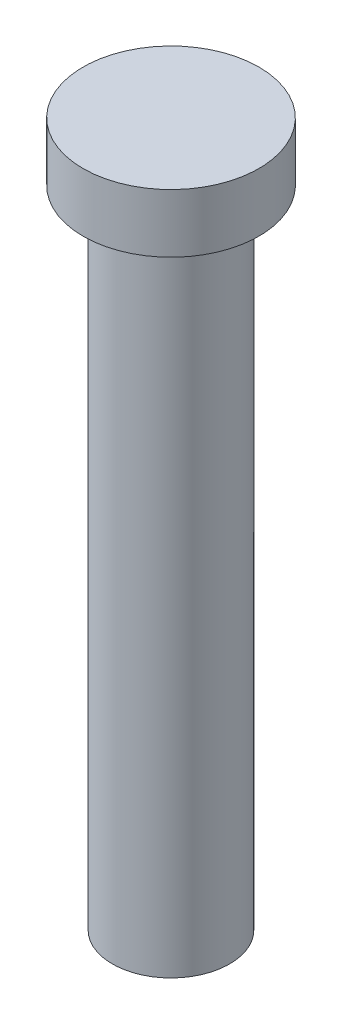
ISO-10303-21;
HEADER;
FILE_DESCRIPTION(('STEP AP214'),'2;1');
FILE_NAME('part.step','',(''),(''),'','','');
FILE_SCHEMA(('AUTOMOTIVE_DESIGN { 1 0 10303 214 1 1 1 1 }'));
ENDSEC;
DATA;
#1=APPLICATION_CONTEXT('core data for automotive mechanical design processes');
#2=APPLICATION_PROTOCOL_DEFINITION('international standard','automotive_design',2000,#1);
#3=PRODUCT_CONTEXT('',#1,'mechanical');
#4=PRODUCT('Part','Part','',(#3));
#5=PRODUCT_RELATED_PRODUCT_CATEGORY('part','',(#4));
#6=PRODUCT_DEFINITION_FORMATION('','',#4);
#7=PRODUCT_DEFINITION_CONTEXT('part definition',#1,'design');
#8=PRODUCT_DEFINITION('design','',#6,#7);
#9=PRODUCT_DEFINITION_SHAPE('','',#8);
#10=(LENGTH_UNIT() NAMED_UNIT(*) SI_UNIT(.MILLI.,.METRE.));
#11=(NAMED_UNIT(*) PLANE_ANGLE_UNIT() SI_UNIT($,.RADIAN.));
#12=(NAMED_UNIT(*) SI_UNIT($,.STERADIAN.) SOLID_ANGLE_UNIT());
#13=UNCERTAINTY_MEASURE_WITH_UNIT(LENGTH_MEASURE(1.E-05),#10,'distance_accuracy_value','');
#14=(GEOMETRIC_REPRESENTATION_CONTEXT(3) GLOBAL_UNCERTAINTY_ASSIGNED_CONTEXT((#13)) GLOBAL_UNIT_ASSIGNED_CONTEXT((#10,
#11,#12)) REPRESENTATION_CONTEXT('',''));
#15=CARTESIAN_POINT('',(0.,0.,0.));
#16=DIRECTION('',(0.,0.,1.));
#17=DIRECTION('',(1.,0.,0.));
#18=AXIS2_PLACEMENT_3D('',#15,#16,#17);
#19=CARTESIAN_POINT('',(0.,10.,0.));
#20=DIRECTION('',(0.,-1.,0.));
#21=DIRECTION('',(0.,0.,-1.));
#22=AXIS2_PLACEMENT_3D('',#19,#20,#21);
#23=CYLINDRICAL_SURFACE('',#22,15.);
#24=CARTESIAN_POINT('',(0.,10.,0.));
#25=DIRECTION('',(0.,1.,0.));
#26=DIRECTION('',(0.,0.,1.));
#27=AXIS2_PLACEMENT_3D('',#24,#25,#26);
#28=CIRCLE('',#27,15.);
#29=CARTESIAN_POINT('',(0.,10.,15.));
#30=VERTEX_POINT('',#29);
#31=EDGE_CURVE('E46',#30,#30,#28,.T.);
#32=ORIENTED_EDGE('',*,*,#31,.F.);
#33=EDGE_LOOP('',(#32));
#34=FACE_BOUND('',#33,.T.);
#35=CARTESIAN_POINT('',(0.,0.,0.));
#36=DIRECTION('',(0.,1.,0.));
#37=DIRECTION('',(0.,0.,1.));
#38=AXIS2_PLACEMENT_3D('',#35,#36,#37);
#39=CIRCLE('',#38,15.);
#40=CARTESIAN_POINT('',(0.,0.,15.));
#41=VERTEX_POINT('',#40);
#42=EDGE_CURVE('E41',#41,#41,#39,.T.);
#43=ORIENTED_EDGE('',*,*,#42,.T.);
#44=EDGE_LOOP('',(#43));
#45=FACE_BOUND('',#44,.T.);
#46=ADVANCED_FACE('F38',(#34,#45),#23,.T.);
#47=CARTESIAN_POINT('',(0.,10.,0.));
#48=DIRECTION('',(0.,1.,0.));
#49=DIRECTION('',(0.,0.,1.));
#50=AXIS2_PLACEMENT_3D('',#47,#48,#49);
#51=PLANE('',#50);
#52=ORIENTED_EDGE('',*,*,#31,.T.);
#53=EDGE_LOOP('',(#52));
#54=FACE_BOUND('',#53,.T.);
#55=ADVANCED_FACE('F66',(#54),#51,.T.);
#56=CARTESIAN_POINT('',(0.,0.,0.));
#57=DIRECTION('',(0.,1.,0.));
#58=DIRECTION('',(0.,0.,1.));
#59=AXIS2_PLACEMENT_3D('',#56,#57,#58);
#60=PLANE('',#59);
#61=CARTESIAN_POINT('',(0.,0.,0.));
#62=DIRECTION('',(0.,-1.,0.));
#63=DIRECTION('',(0.,0.,-1.));
#64=AXIS2_PLACEMENT_3D('',#61,#62,#63);
#65=CIRCLE('',#64,10.);
#66=CARTESIAN_POINT('',(0.,0.,-10.));
#67=VERTEX_POINT('',#66);
#68=EDGE_CURVE('E10',#67,#67,#65,.T.);
#69=ORIENTED_EDGE('',*,*,#68,.F.);
#70=EDGE_LOOP('',(#69));
#71=FACE_BOUND('',#70,.T.);
#72=ORIENTED_EDGE('',*,*,#42,.F.);
#73=EDGE_LOOP('',(#72));
#74=FACE_BOUND('',#73,.T.);
#75=ADVANCED_FACE('F63',(#71,#74),#60,.F.);
#76=CARTESIAN_POINT('',(0.,-110.,0.));
#77=DIRECTION('',(0.,1.,0.));
#78=DIRECTION('',(0.,0.,1.));
#79=AXIS2_PLACEMENT_3D('',#76,#77,#78);
#80=CYLINDRICAL_SURFACE('',#79,10.);
#81=CARTESIAN_POINT('',(0.,-110.,0.));
#82=DIRECTION('',(0.,-1.,0.));
#83=DIRECTION('',(0.,0.,-1.));
#84=AXIS2_PLACEMENT_3D('',#81,#82,#83);
#85=CIRCLE('',#84,10.);
#86=CARTESIAN_POINT('',(0.,-110.,-10.));
#87=VERTEX_POINT('',#86);
#88=EDGE_CURVE('E53',#87,#87,#85,.T.);
#89=ORIENTED_EDGE('',*,*,#88,.F.);
#90=EDGE_LOOP('',(#89));
#91=FACE_BOUND('',#90,.T.);
#92=ORIENTED_EDGE('',*,*,#68,.T.);
#93=EDGE_LOOP('',(#92));
#94=FACE_BOUND('',#93,.T.);
#95=ADVANCED_FACE('F65',(#91,#94),#80,.T.);
#96=CARTESIAN_POINT('',(0.,-110.,0.));
#97=DIRECTION('',(0.,-1.,0.));
#98=DIRECTION('',(0.,0.,-1.));
#99=AXIS2_PLACEMENT_3D('',#96,#97,#98);
#100=PLANE('',#99);
#101=ORIENTED_EDGE('',*,*,#88,.T.);
#102=EDGE_LOOP('',(#101));
#103=FACE_BOUND('',#102,.T.);
#104=ADVANCED_FACE('F72',(#103),#100,.T.);
#105=CLOSED_SHELL('',(#46,#55,#75,#95,#104));
#106=MANIFOLD_SOLID_BREP('B2',#105);
#107=ADVANCED_BREP_SHAPE_REPRESENTATION('',(#18,#106),#14);
#108=SHAPE_DEFINITION_REPRESENTATION(#9,#107);
ENDSEC;
END-ISO-10303-21;
